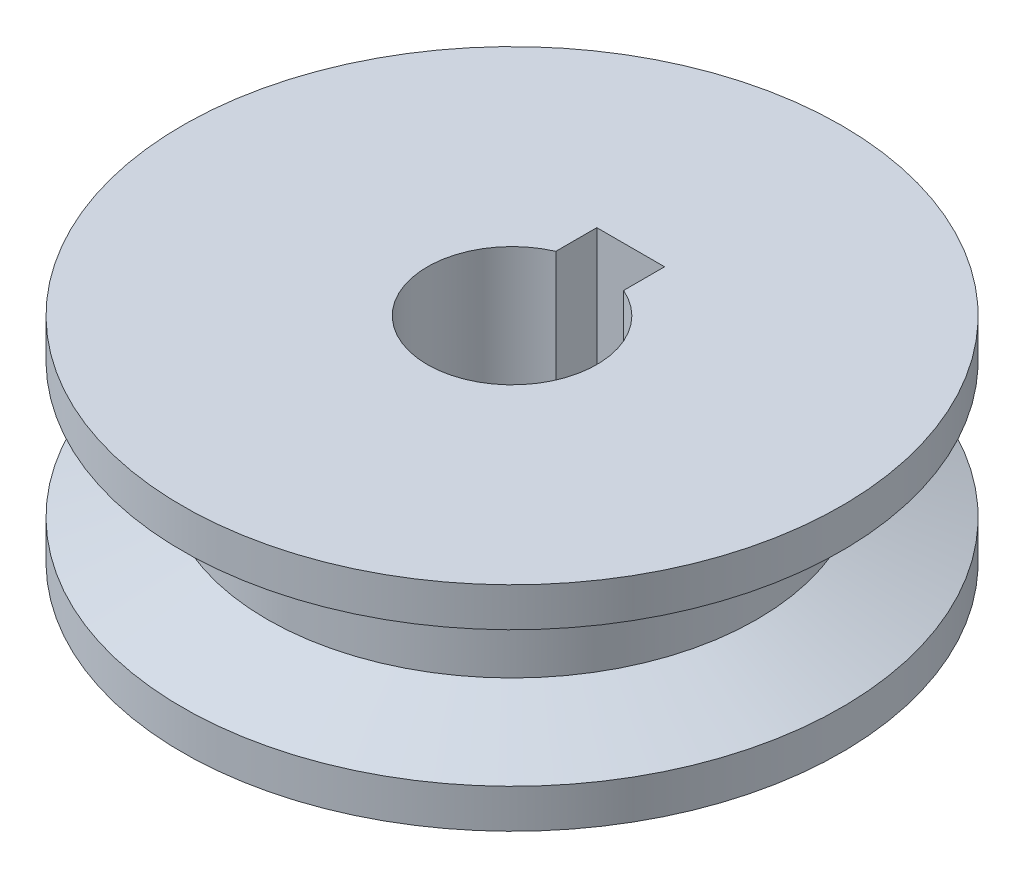
ISO-10303-21;
HEADER;
FILE_DESCRIPTION(('STEP AP214'),'2;1');
FILE_NAME('part.step','',(''),(''),'','','');
FILE_SCHEMA(('AUTOMOTIVE_DESIGN { 1 0 10303 214 1 1 1 1 }'));
ENDSEC;
DATA;
#1=APPLICATION_CONTEXT('core data for automotive mechanical design processes');
#2=APPLICATION_PROTOCOL_DEFINITION('international standard','automotive_design',2000,#1);
#3=PRODUCT_CONTEXT('',#1,'mechanical');
#4=PRODUCT('Part','Part','',(#3));
#5=PRODUCT_RELATED_PRODUCT_CATEGORY('part','',(#4));
#6=PRODUCT_DEFINITION_FORMATION('','',#4);
#7=PRODUCT_DEFINITION_CONTEXT('part definition',#1,'design');
#8=PRODUCT_DEFINITION('design','',#6,#7);
#9=PRODUCT_DEFINITION_SHAPE('','',#8);
#10=(LENGTH_UNIT() NAMED_UNIT(*) SI_UNIT(.MILLI.,.METRE.));
#11=(NAMED_UNIT(*) PLANE_ANGLE_UNIT() SI_UNIT($,.RADIAN.));
#12=(NAMED_UNIT(*) SI_UNIT($,.STERADIAN.) SOLID_ANGLE_UNIT());
#13=UNCERTAINTY_MEASURE_WITH_UNIT(LENGTH_MEASURE(1.E-05),#10,'distance_accuracy_value','');
#14=(GEOMETRIC_REPRESENTATION_CONTEXT(3) GLOBAL_UNCERTAINTY_ASSIGNED_CONTEXT((#13)) GLOBAL_UNIT_ASSIGNED_CONTEXT((#10,
#11,#12)) REPRESENTATION_CONTEXT('',''));
#15=CARTESIAN_POINT('',(0.,0.,0.));
#16=DIRECTION('',(0.,0.,1.));
#17=DIRECTION('',(1.,0.,0.));
#18=AXIS2_PLACEMENT_3D('',#15,#16,#17);
#19=CARTESIAN_POINT('',(30.875,0.,0.));
#20=DIRECTION('',(0.,-1.,0.));
#21=DIRECTION('',(0.,0.,-1.));
#22=AXIS2_PLACEMENT_3D('',#19,#20,#21);
#23=PLANE('',#22);
#24=CARTESIAN_POINT('',(0.,0.,0.));
#25=DIRECTION('',(0.,-1.,0.));
#26=DIRECTION('',(0.,0.,-1.));
#27=AXIS2_PLACEMENT_3D('',#24,#25,#26);
#28=CIRCLE('',#27,30.875);
#29=CARTESIAN_POINT('',(0.,0.,-30.875));
#30=VERTEX_POINT('',#29);
#31=EDGE_CURVE('E115',#30,#30,#28,.T.);
#32=ORIENTED_EDGE('',*,*,#31,.T.);
#33=EDGE_LOOP('',(#32));
#34=FACE_BOUND('',#33,.T.);
#35=DIRECTION('',(1.,0.,0.));
#36=VECTOR('',#35,1.);
#37=CARTESIAN_POINT('',(0.,0.,-11.1125));
#38=LINE('',#37,#36);
#39=CARTESIAN_POINT('',(-3.175,0.,-11.1125));
#40=VERTEX_POINT('',#39);
#41=CARTESIAN_POINT('',(3.175,0.,-11.1125));
#42=VERTEX_POINT('',#41);
#43=EDGE_CURVE('E86',#40,#42,#38,.T.);
#44=ORIENTED_EDGE('',*,*,#43,.F.);
#45=DIRECTION('',(0.,0.,-1.));
#46=VECTOR('',#45,1.);
#47=CARTESIAN_POINT('',(-3.175,0.,0.));
#48=LINE('',#47,#46);
#49=CARTESIAN_POINT('',(-3.175,0.,-7.2748389157424));
#50=VERTEX_POINT('',#49);
#51=EDGE_CURVE('E93',#50,#40,#48,.T.);
#52=ORIENTED_EDGE('',*,*,#51,.F.);
#53=CARTESIAN_POINT('',(0.,0.,0.));
#54=DIRECTION('',(0.,-1.,0.));
#55=DIRECTION('',(0.,0.,-1.));
#56=AXIS2_PLACEMENT_3D('',#53,#54,#55);
#57=CIRCLE('',#56,7.9375);
#58=CARTESIAN_POINT('',(3.175,0.,-7.2748389157424));
#59=VERTEX_POINT('',#58);
#60=EDGE_CURVE('E11',#59,#50,#57,.T.);
#61=ORIENTED_EDGE('',*,*,#60,.F.);
#62=DIRECTION('',(0.,0.,-1.));
#63=VECTOR('',#62,1.);
#64=CARTESIAN_POINT('',(3.175,0.,0.));
#65=LINE('',#64,#63);
#66=EDGE_CURVE('E81',#59,#42,#65,.T.);
#67=ORIENTED_EDGE('',*,*,#66,.T.);
#68=EDGE_LOOP('',(#44,#52,#61,#67));
#69=FACE_BOUND('',#68,.T.);
#70=ADVANCED_FACE('F39',(#34,#69),#23,.T.);
#71=CARTESIAN_POINT('',(0.,0.,0.));
#72=DIRECTION('',(0.,-1.,0.));
#73=DIRECTION('',(0.,0.,-1.));
#74=AXIS2_PLACEMENT_3D('',#71,#72,#73);
#75=CYLINDRICAL_SURFACE('',#74,7.9375);
#76=ORIENTED_EDGE('',*,*,#60,.T.);
#77=DIRECTION('',(0.,1.,0.));
#78=VECTOR('',#77,1.);
#79=CARTESIAN_POINT('',(-3.175,0.,-7.2748389157424));
#80=LINE('',#79,#78);
#81=CARTESIAN_POINT('',(-3.175,20.,-7.2748389157424));
#82=VERTEX_POINT('',#81);
#83=EDGE_CURVE('E63',#50,#82,#80,.T.);
#84=ORIENTED_EDGE('',*,*,#83,.T.);
#85=CARTESIAN_POINT('',(0.,20.,0.));
#86=DIRECTION('',(0.,-1.,0.));
#87=DIRECTION('',(0.,0.,-1.));
#88=AXIS2_PLACEMENT_3D('',#85,#86,#87);
#89=CIRCLE('',#88,7.9375);
#90=CARTESIAN_POINT('',(3.175,20.,-7.2748389157424));
#91=VERTEX_POINT('',#90);
#92=EDGE_CURVE('E47',#91,#82,#89,.T.);
#93=ORIENTED_EDGE('',*,*,#92,.F.);
#94=DIRECTION('',(0.,1.,0.));
#95=VECTOR('',#94,1.);
#96=CARTESIAN_POINT('',(3.175,0.,-7.2748389157424));
#97=LINE('',#96,#95);
#98=EDGE_CURVE('E54',#59,#91,#97,.T.);
#99=ORIENTED_EDGE('',*,*,#98,.F.);
#100=EDGE_LOOP('',(#76,#84,#93,#99));
#101=FACE_BOUND('',#100,.T.);
#102=ADVANCED_FACE('F148',(#101),#75,.F.);
#103=CARTESIAN_POINT('',(7.9375,20.,0.));
#104=DIRECTION('',(0.,1.,0.));
#105=DIRECTION('',(0.,0.,1.));
#106=AXIS2_PLACEMENT_3D('',#103,#104,#105);
#107=PLANE('',#106);
#108=CARTESIAN_POINT('',(0.,20.,0.));
#109=DIRECTION('',(0.,-1.,0.));
#110=DIRECTION('',(0.,0.,-1.));
#111=AXIS2_PLACEMENT_3D('',#108,#109,#110);
#112=CIRCLE('',#111,30.875);
#113=CARTESIAN_POINT('',(0.,20.,-30.875));
#114=VERTEX_POINT('',#113);
#115=EDGE_CURVE('E139',#114,#114,#112,.T.);
#116=ORIENTED_EDGE('',*,*,#115,.F.);
#117=EDGE_LOOP('',(#116));
#118=FACE_BOUND('',#117,.T.);
#119=ORIENTED_EDGE('',*,*,#92,.T.);
#120=DIRECTION('',(0.,0.,-1.));
#121=VECTOR('',#120,1.);
#122=CARTESIAN_POINT('',(-3.175,20.,0.));
#123=LINE('',#122,#121);
#124=CARTESIAN_POINT('',(-3.175,20.,-11.1125));
#125=VERTEX_POINT('',#124);
#126=EDGE_CURVE('E77',#82,#125,#123,.T.);
#127=ORIENTED_EDGE('',*,*,#126,.T.);
#128=DIRECTION('',(1.,0.,0.));
#129=VECTOR('',#128,1.);
#130=CARTESIAN_POINT('',(0.,20.,-11.1125));
#131=LINE('',#130,#129);
#132=CARTESIAN_POINT('',(3.175,20.,-11.1125));
#133=VERTEX_POINT('',#132);
#134=EDGE_CURVE('E104',#125,#133,#131,.T.);
#135=ORIENTED_EDGE('',*,*,#134,.T.);
#136=DIRECTION('',(0.,0.,-1.));
#137=VECTOR('',#136,1.);
#138=CARTESIAN_POINT('',(3.175,20.,0.));
#139=LINE('',#138,#137);
#140=EDGE_CURVE('E96',#91,#133,#139,.T.);
#141=ORIENTED_EDGE('',*,*,#140,.F.);
#142=EDGE_LOOP('',(#119,#127,#135,#141));
#143=FACE_BOUND('',#142,.T.);
#144=ADVANCED_FACE('F146',(#118,#143),#107,.T.);
#145=CARTESIAN_POINT('',(0.,0.,0.));
#146=DIRECTION('',(0.,-1.,0.));
#147=DIRECTION('',(0.,0.,-1.));
#148=AXIS2_PLACEMENT_3D('',#145,#146,#147);
#149=CYLINDRICAL_SURFACE('',#148,30.875);
#150=ORIENTED_EDGE('',*,*,#115,.T.);
#151=EDGE_LOOP('',(#150));
#152=FACE_BOUND('',#151,.T.);
#153=CARTESIAN_POINT('',(0.,16.35,0.));
#154=DIRECTION('',(0.,-1.,0.));
#155=DIRECTION('',(0.,0.,-1.));
#156=AXIS2_PLACEMENT_3D('',#153,#154,#155);
#157=CIRCLE('',#156,30.875);
#158=CARTESIAN_POINT('',(0.,16.35,-30.875));
#159=VERTEX_POINT('',#158);
#160=EDGE_CURVE('E135',#159,#159,#157,.T.);
#161=ORIENTED_EDGE('',*,*,#160,.F.);
#162=EDGE_LOOP('',(#161));
#163=FACE_BOUND('',#162,.T.);
#164=ADVANCED_FACE('F154',(#152,#163),#149,.T.);
#165=CARTESIAN_POINT('',(0.,13.175,0.));
#166=DIRECTION('',(0.,1.,0.));
#167=DIRECTION('',(0.,0.,1.));
#168=AXIS2_PLACEMENT_3D('',#165,#166,#167);
#169=CONICAL_SURFACE('',#168,22.9375,1.19028994968253);
#170=ORIENTED_EDGE('',*,*,#160,.T.);
#171=EDGE_LOOP('',(#170));
#172=FACE_BOUND('',#171,.T.);
#173=CARTESIAN_POINT('',(0.,13.175,0.));
#174=DIRECTION('',(0.,-1.,0.));
#175=DIRECTION('',(0.,0.,-1.));
#176=AXIS2_PLACEMENT_3D('',#173,#174,#175);
#177=CIRCLE('',#176,22.9375);
#178=CARTESIAN_POINT('',(0.,13.175,-22.9375));
#179=VERTEX_POINT('',#178);
#180=EDGE_CURVE('E131',#179,#179,#177,.T.);
#181=ORIENTED_EDGE('',*,*,#180,.F.);
#182=EDGE_LOOP('',(#181));
#183=FACE_BOUND('',#182,.T.);
#184=ADVANCED_FACE('F161',(#172,#183),#169,.T.);
#185=CARTESIAN_POINT('',(0.,0.,0.));
#186=DIRECTION('',(0.,-1.,0.));
#187=DIRECTION('',(0.,0.,-1.));
#188=AXIS2_PLACEMENT_3D('',#185,#186,#187);
#189=CYLINDRICAL_SURFACE('',#188,22.9375);
#190=ORIENTED_EDGE('',*,*,#180,.T.);
#191=EDGE_LOOP('',(#190));
#192=FACE_BOUND('',#191,.T.);
#193=CARTESIAN_POINT('',(0.,6.825,0.));
#194=DIRECTION('',(0.,-1.,0.));
#195=DIRECTION('',(0.,0.,-1.));
#196=AXIS2_PLACEMENT_3D('',#193,#194,#195);
#197=CIRCLE('',#196,22.9375);
#198=CARTESIAN_POINT('',(0.,6.825,-22.9375));
#199=VERTEX_POINT('',#198);
#200=EDGE_CURVE('E127',#199,#199,#197,.T.);
#201=ORIENTED_EDGE('',*,*,#200,.F.);
#202=EDGE_LOOP('',(#201));
#203=FACE_BOUND('',#202,.T.);
#204=ADVANCED_FACE('F165',(#192,#203),#189,.T.);
#205=CARTESIAN_POINT('',(0.,3.65,0.));
#206=DIRECTION('',(0.,-1.,0.));
#207=DIRECTION('',(0.,0.,-1.));
#208=AXIS2_PLACEMENT_3D('',#205,#206,#207);
#209=CONICAL_SURFACE('',#208,30.875,1.19028994968253);
#210=ORIENTED_EDGE('',*,*,#200,.T.);
#211=EDGE_LOOP('',(#210));
#212=FACE_BOUND('',#211,.T.);
#213=CARTESIAN_POINT('',(0.,3.65,0.));
#214=DIRECTION('',(0.,-1.,0.));
#215=DIRECTION('',(0.,0.,-1.));
#216=AXIS2_PLACEMENT_3D('',#213,#214,#215);
#217=CIRCLE('',#216,30.875);
#218=CARTESIAN_POINT('',(0.,3.65,-30.875));
#219=VERTEX_POINT('',#218);
#220=EDGE_CURVE('E123',#219,#219,#217,.T.);
#221=ORIENTED_EDGE('',*,*,#220,.F.);
#222=EDGE_LOOP('',(#221));
#223=FACE_BOUND('',#222,.T.);
#224=ADVANCED_FACE('F169',(#212,#223),#209,.T.);
#225=CARTESIAN_POINT('',(0.,0.,0.));
#226=DIRECTION('',(0.,-1.,0.));
#227=DIRECTION('',(0.,0.,-1.));
#228=AXIS2_PLACEMENT_3D('',#225,#226,#227);
#229=CYLINDRICAL_SURFACE('',#228,30.875);
#230=ORIENTED_EDGE('',*,*,#220,.T.);
#231=EDGE_LOOP('',(#230));
#232=FACE_BOUND('',#231,.T.);
#233=ORIENTED_EDGE('',*,*,#31,.F.);
#234=EDGE_LOOP('',(#233));
#235=FACE_BOUND('',#234,.T.);
#236=ADVANCED_FACE('F173',(#232,#235),#229,.T.);
#237=CARTESIAN_POINT('',(-3.175,0.,0.));
#238=DIRECTION('',(1.,0.,0.));
#239=DIRECTION('',(0.,0.,-1.));
#240=AXIS2_PLACEMENT_3D('',#237,#238,#239);
#241=PLANE('',#240);
#242=ORIENTED_EDGE('',*,*,#126,.F.);
#243=ORIENTED_EDGE('',*,*,#83,.F.);
#244=ORIENTED_EDGE('',*,*,#51,.T.);
#245=DIRECTION('',(0.,1.,0.));
#246=VECTOR('',#245,1.);
#247=CARTESIAN_POINT('',(-3.175,0.,-11.1125));
#248=LINE('',#247,#246);
#249=EDGE_CURVE('E90',#40,#125,#248,.T.);
#250=ORIENTED_EDGE('',*,*,#249,.T.);
#251=EDGE_LOOP('',(#242,#243,#244,#250));
#252=FACE_BOUND('',#251,.T.);
#253=ADVANCED_FACE('F177',(#252),#241,.T.);
#254=CARTESIAN_POINT('',(0.,0.,-11.1125));
#255=DIRECTION('',(0.,0.,1.));
#256=DIRECTION('',(1.,0.,0.));
#257=AXIS2_PLACEMENT_3D('',#254,#255,#256);
#258=PLANE('',#257);
#259=ORIENTED_EDGE('',*,*,#134,.F.);
#260=ORIENTED_EDGE('',*,*,#249,.F.);
#261=ORIENTED_EDGE('',*,*,#43,.T.);
#262=DIRECTION('',(0.,1.,0.));
#263=VECTOR('',#262,1.);
#264=CARTESIAN_POINT('',(3.175,0.,-11.1125));
#265=LINE('',#264,#263);
#266=EDGE_CURVE('E89',#42,#133,#265,.T.);
#267=ORIENTED_EDGE('',*,*,#266,.T.);
#268=EDGE_LOOP('',(#259,#260,#261,#267));
#269=FACE_BOUND('',#268,.T.);
#270=ADVANCED_FACE('F88',(#269),#258,.T.);
#271=CARTESIAN_POINT('',(3.175,0.,0.));
#272=DIRECTION('',(1.,0.,0.));
#273=DIRECTION('',(0.,0.,-1.));
#274=AXIS2_PLACEMENT_3D('',#271,#272,#273);
#275=PLANE('',#274);
#276=ORIENTED_EDGE('',*,*,#140,.T.);
#277=ORIENTED_EDGE('',*,*,#266,.F.);
#278=ORIENTED_EDGE('',*,*,#66,.F.);
#279=ORIENTED_EDGE('',*,*,#98,.T.);
#280=EDGE_LOOP('',(#276,#277,#278,#279));
#281=FACE_BOUND('',#280,.T.);
#282=ADVANCED_FACE('F95',(#281),#275,.F.);
#283=CLOSED_SHELL('',(#70,#102,#144,#164,#184,#204,#224,#236,#253,#270,#282));
#284=MANIFOLD_SOLID_BREP('B2',#283);
#285=ADVANCED_BREP_SHAPE_REPRESENTATION('',(#18,#284),#14);
#286=SHAPE_DEFINITION_REPRESENTATION(#9,#285);
ENDSEC;
END-ISO-10303-21;
